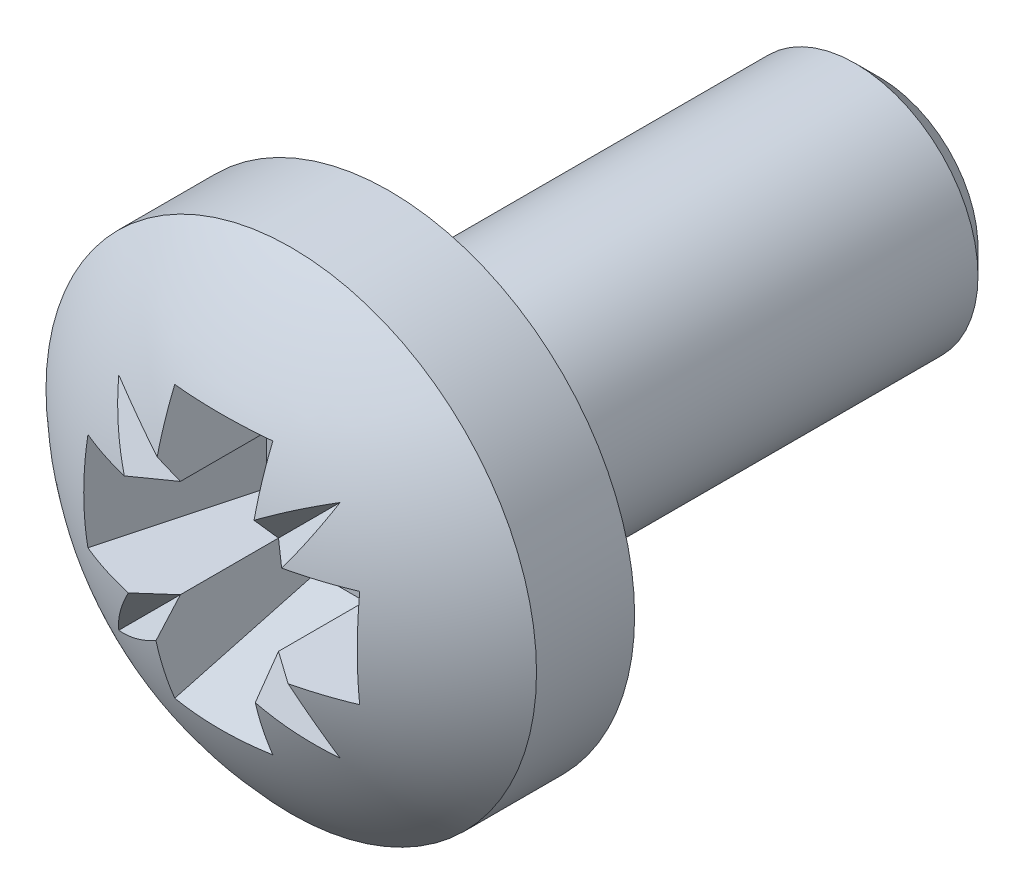
ISO-10303-21;
HEADER;
FILE_DESCRIPTION(('STEP AP214'),'2;1');
FILE_NAME('part.step','',(''),(''),'','','');
FILE_SCHEMA(('AUTOMOTIVE_DESIGN { 1 0 10303 214 1 1 1 1 }'));
ENDSEC;
DATA;
#1=APPLICATION_CONTEXT('core data for automotive mechanical design processes');
#2=APPLICATION_PROTOCOL_DEFINITION('international standard','automotive_design',2000,#1);
#3=PRODUCT_CONTEXT('',#1,'mechanical');
#4=PRODUCT('Part','Part','',(#3));
#5=PRODUCT_RELATED_PRODUCT_CATEGORY('part','',(#4));
#6=PRODUCT_DEFINITION_FORMATION('','',#4);
#7=PRODUCT_DEFINITION_CONTEXT('part definition',#1,'design');
#8=PRODUCT_DEFINITION('design','',#6,#7);
#9=PRODUCT_DEFINITION_SHAPE('','',#8);
#10=(LENGTH_UNIT() NAMED_UNIT(*) SI_UNIT(.MILLI.,.METRE.));
#11=(NAMED_UNIT(*) PLANE_ANGLE_UNIT() SI_UNIT($,.RADIAN.));
#12=(NAMED_UNIT(*) SI_UNIT($,.STERADIAN.) SOLID_ANGLE_UNIT());
#13=UNCERTAINTY_MEASURE_WITH_UNIT(LENGTH_MEASURE(1.E-05),#10,'distance_accuracy_value','');
#14=(GEOMETRIC_REPRESENTATION_CONTEXT(3) GLOBAL_UNCERTAINTY_ASSIGNED_CONTEXT((#13)) GLOBAL_UNIT_ASSIGNED_CONTEXT((#10,
#11,#12)) REPRESENTATION_CONTEXT('',''));
#15=CARTESIAN_POINT('',(0.,0.,0.));
#16=DIRECTION('',(0.,0.,1.));
#17=DIRECTION('',(1.,0.,0.));
#18=AXIS2_PLACEMENT_3D('',#15,#16,#17);
#19=CARTESIAN_POINT('',(0.,0.,1.));
#20=DIRECTION('',(0.,0.,-1.));
#21=DIRECTION('',(-1.,0.,0.));
#22=AXIS2_PLACEMENT_3D('',#19,#20,#21);
#23=CYLINDRICAL_SURFACE('',#22,2.5);
#24=CARTESIAN_POINT('',(0.,0.,1.));
#25=DIRECTION('',(0.,0.,1.));
#26=DIRECTION('',(1.,0.,0.));
#27=AXIS2_PLACEMENT_3D('',#24,#25,#26);
#28=CIRCLE('',#27,2.5);
#29=CARTESIAN_POINT('',(2.5,0.,1.));
#30=VERTEX_POINT('',#29);
#31=EDGE_CURVE('E264',#30,#30,#28,.T.);
#32=ORIENTED_EDGE('',*,*,#31,.F.);
#33=EDGE_LOOP('',(#32));
#34=FACE_BOUND('',#33,.T.);
#35=CARTESIAN_POINT('',(0.,0.,0.));
#36=DIRECTION('',(0.,0.,1.));
#37=DIRECTION('',(1.,0.,0.));
#38=AXIS2_PLACEMENT_3D('',#35,#36,#37);
#39=CIRCLE('',#38,2.5);
#40=CARTESIAN_POINT('',(2.5,0.,0.));
#41=VERTEX_POINT('',#40);
#42=EDGE_CURVE('E248',#41,#41,#39,.T.);
#43=ORIENTED_EDGE('',*,*,#42,.T.);
#44=EDGE_LOOP('',(#43));
#45=FACE_BOUND('',#44,.T.);
#46=ADVANCED_FACE('F33',(#34,#45),#23,.T.);
#47=CARTESIAN_POINT('',(0.,0.,-1.625));
#48=DIRECTION('',(0.,0.,1.));
#49=DIRECTION('',(1.,0.,0.));
#50=AXIS2_PLACEMENT_3D('',#47,#48,#49);
#51=SPHERICAL_SURFACE('',#50,3.625);
#52=CARTESIAN_POINT('',(-1.15094556789194,-1.15094556789194,0.00268283166649885));
#53=DIRECTION('',(0.499999999999922,0.499999999999921,-0.707106781186659));
#54=DIRECTION('',(-0.816496580927812,0.,-0.577350269189505));
#55=AXIS2_PLACEMENT_3D('',#52,#53,#54);
#56=CIRCLE('',#55,2.80034322878427);
#57=CARTESIAN_POINT('',(1.12765672923971,-1.12765672923971,1.63036566333197));
#58=VERTEX_POINT('',#57);
#59=CARTESIAN_POINT('',(0.834639062342882,-0.5,1.86699121356446));
#60=VERTEX_POINT('',#59);
#61=EDGE_CURVE('E48',#58,#60,#56,.F.);
#62=ORIENTED_EDGE('',*,*,#61,.F.);
#63=CARTESIAN_POINT('',(1.15094556789194,1.15094556789194,0.00268283166647955));
#64=DIRECTION('',(-0.499999999999924,-0.499999999999924,-0.707106781186655));
#65=DIRECTION('',(-0.816496580927809,0.,0.577350269189509));
#66=AXIS2_PLACEMENT_3D('',#63,#64,#65);
#67=CIRCLE('',#66,2.80034322878428);
#68=CARTESIAN_POINT('',(0.5,-0.834639062342882,1.86699121356446));
#69=VERTEX_POINT('',#68);
#70=EDGE_CURVE('E167',#69,#58,#67,.F.);
#71=ORIENTED_EDGE('',*,*,#70,.F.);
#72=CARTESIAN_POINT('',(0.5,0.,-1.625));
#73=DIRECTION('',(1.,0.,0.));
#74=DIRECTION('',(0.,1.,0.));
#75=AXIS2_PLACEMENT_3D('',#72,#73,#74);
#76=CIRCLE('',#75,3.59035165408627);
#77=CARTESIAN_POINT('',(0.5,-1.38514981453768,1.68739867638034));
#78=VERTEX_POINT('',#77);
#79=EDGE_CURVE('E278',#78,#69,#76,.F.);
#80=ORIENTED_EDGE('',*,*,#79,.F.);
#81=CARTESIAN_POINT('',(0.,-0.464262701892218,-1.74939881604791));
#82=DIRECTION('',(0.,0.965925826289068,0.258819045102521));
#83=DIRECTION('',(0.,-0.258819045102521,0.965925826289068));
#84=AXIS2_PLACEMENT_3D('',#81,#82,#83);
#85=CIRCLE('',#84,3.59299458365826);
#86=CARTESIAN_POINT('',(-0.5,-1.38514981453768,1.68739867638034));
#87=VERTEX_POINT('',#86);
#88=EDGE_CURVE('E295',#87,#78,#85,.T.);
#89=ORIENTED_EDGE('',*,*,#88,.F.);
#90=CARTESIAN_POINT('',(-0.5,0.,-1.625));
#91=DIRECTION('',(-1.,0.,0.));
#92=DIRECTION('',(0.,-1.,0.));
#93=AXIS2_PLACEMENT_3D('',#90,#91,#92);
#94=CIRCLE('',#93,3.59035165408627);
#95=CARTESIAN_POINT('',(-0.5,-0.781338878854619,1.8793022923815));
#96=VERTEX_POINT('',#95);
#97=EDGE_CURVE('E290',#96,#87,#94,.F.);
#98=ORIENTED_EDGE('',*,*,#97,.F.);
#99=CARTESIAN_POINT('',(-1.12260978110972,1.12260978110972,-0.356268361692934));
#100=DIRECTION('',(0.552387761143332,-0.552387761143333,-0.624288012601646));
#101=DIRECTION('',(0.,0.748917388741033,-0.662663372189313));
#102=AXIS2_PLACEMENT_3D('',#99,#100,#101);
#103=CIRCLE('',#102,3.00173942717756);
#104=CARTESIAN_POINT('',(-1.12765672923971,-1.12765672923971,1.63036566333197));
#105=VERTEX_POINT('',#104);
#106=EDGE_CURVE('E206',#105,#96,#103,.F.);
#107=ORIENTED_EDGE('',*,*,#106,.F.);
#108=CARTESIAN_POINT('',(1.12260978110972,-1.12260978110972,-0.356268361692928));
#109=DIRECTION('',(-0.552387761143332,0.552387761143332,-0.624288012601647));
#110=DIRECTION('',(0.,0.748917388741035,0.662663372189311));
#111=AXIS2_PLACEMENT_3D('',#108,#109,#110);
#112=CIRCLE('',#111,3.00173942717756);
#113=CARTESIAN_POINT('',(-0.781338878854624,-0.500000000000001,1.8793022923815));
#114=VERTEX_POINT('',#113);
#115=EDGE_CURVE('E200',#114,#105,#112,.F.);
#116=ORIENTED_EDGE('',*,*,#115,.F.);
#117=CARTESIAN_POINT('',(0.,-0.500000000000001,-1.625));
#118=DIRECTION('',(0.,-1.,0.));
#119=DIRECTION('',(1.,0.,0.));
#120=AXIS2_PLACEMENT_3D('',#117,#118,#119);
#121=CIRCLE('',#120,3.59035165408627);
#122=CARTESIAN_POINT('',(-1.38514981453768,-0.500000000000001,1.68739867638034));
#123=VERTEX_POINT('',#122);
#124=EDGE_CURVE('E286',#123,#114,#121,.F.);
#125=ORIENTED_EDGE('',*,*,#124,.F.);
#126=CARTESIAN_POINT('',(-0.464262701892218,0.,-1.74939881604791));
#127=DIRECTION('',(0.965925826289068,0.,0.258819045102521));
#128=DIRECTION('',(0.258819045102521,0.,-0.965925826289068));
#129=AXIS2_PLACEMENT_3D('',#126,#127,#128);
#130=CIRCLE('',#129,3.59299458365826);
#131=CARTESIAN_POINT('',(-1.38514981453768,0.500000000000001,1.68739867638034));
#132=VERTEX_POINT('',#131);
#133=EDGE_CURVE('E274',#132,#123,#130,.T.);
#134=ORIENTED_EDGE('',*,*,#133,.F.);
#135=CARTESIAN_POINT('',(0.,0.500000000000001,-1.625));
#136=DIRECTION('',(0.,1.,0.));
#137=DIRECTION('',(-1.,0.,0.));
#138=AXIS2_PLACEMENT_3D('',#135,#136,#137);
#139=CIRCLE('',#138,3.59035165408627);
#140=CARTESIAN_POINT('',(-0.834639062342883,0.500000000000001,1.86699121356446));
#141=VERTEX_POINT('',#140);
#142=EDGE_CURVE('E176',#141,#132,#139,.F.);
#143=ORIENTED_EDGE('',*,*,#142,.F.);
#144=CARTESIAN_POINT('',(-1.12765672923971,1.12765672923971,1.63036566333197));
#145=VERTEX_POINT('',#144);
#146=EDGE_CURVE('E56',#145,#141,#67,.F.);
#147=ORIENTED_EDGE('',*,*,#146,.F.);
#148=CARTESIAN_POINT('',(-0.5,0.834639062342884,1.86699121356446));
#149=VERTEX_POINT('',#148);
#150=EDGE_CURVE('E160',#149,#145,#56,.F.);
#151=ORIENTED_EDGE('',*,*,#150,.F.);
#152=CARTESIAN_POINT('',(-0.5,0.,-1.625));
#153=DIRECTION('',(-1.,0.,0.));
#154=DIRECTION('',(0.,-1.,0.));
#155=AXIS2_PLACEMENT_3D('',#152,#153,#154);
#156=CIRCLE('',#155,3.59035165408627);
#157=CARTESIAN_POINT('',(-0.5,1.38514981453768,1.68739867638034));
#158=VERTEX_POINT('',#157);
#159=EDGE_CURVE('E285',#158,#149,#156,.F.);
#160=ORIENTED_EDGE('',*,*,#159,.F.);
#161=CARTESIAN_POINT('',(0.,0.464262701892218,-1.74939881604791));
#162=DIRECTION('',(0.,-0.965925826289068,0.258819045102521));
#163=DIRECTION('',(0.,-0.258819045102521,-0.965925826289068));
#164=AXIS2_PLACEMENT_3D('',#161,#162,#163);
#165=CIRCLE('',#164,3.59299458365826);
#166=CARTESIAN_POINT('',(0.5,1.38514981453768,1.68739867638034));
#167=VERTEX_POINT('',#166);
#168=EDGE_CURVE('E292',#167,#158,#165,.T.);
#169=ORIENTED_EDGE('',*,*,#168,.F.);
#170=CARTESIAN_POINT('',(0.5,0.,-1.625));
#171=DIRECTION('',(1.,0.,0.));
#172=DIRECTION('',(0.,1.,0.));
#173=AXIS2_PLACEMENT_3D('',#170,#171,#172);
#174=CIRCLE('',#173,3.59035165408627);
#175=CARTESIAN_POINT('',(0.5,0.78133887885462,1.8793022923815));
#176=VERTEX_POINT('',#175);
#177=EDGE_CURVE('E283',#176,#167,#174,.F.);
#178=ORIENTED_EDGE('',*,*,#177,.F.);
#179=CARTESIAN_POINT('',(1.12765672923971,1.12765672923971,1.63036566333197));
#180=VERTEX_POINT('',#179);
#181=EDGE_CURVE('E197',#180,#176,#112,.F.);
#182=ORIENTED_EDGE('',*,*,#181,.F.);
#183=CARTESIAN_POINT('',(0.781338878854622,0.5,1.8793022923815));
#184=VERTEX_POINT('',#183);
#185=EDGE_CURVE('E203',#184,#180,#103,.F.);
#186=ORIENTED_EDGE('',*,*,#185,.F.);
#187=CARTESIAN_POINT('',(0.,0.5,-1.625));
#188=DIRECTION('',(0.,1.,0.));
#189=DIRECTION('',(-1.,0.,0.));
#190=AXIS2_PLACEMENT_3D('',#187,#188,#189);
#191=CIRCLE('',#190,3.59035165408627);
#192=CARTESIAN_POINT('',(1.38514981453768,0.499999999999999,1.68739867638034));
#193=VERTEX_POINT('',#192);
#194=EDGE_CURVE('E280',#193,#184,#191,.F.);
#195=ORIENTED_EDGE('',*,*,#194,.F.);
#196=CARTESIAN_POINT('',(0.464262701892218,0.,-1.74939881604791));
#197=DIRECTION('',(-0.965925826289068,0.,0.258819045102521));
#198=DIRECTION('',(0.258819045102521,0.,0.965925826289068));
#199=AXIS2_PLACEMENT_3D('',#196,#197,#198);
#200=CIRCLE('',#199,3.59299458365826);
#201=CARTESIAN_POINT('',(1.38514981453768,-0.499999999999999,1.68739867638034));
#202=VERTEX_POINT('',#201);
#203=EDGE_CURVE('E279',#202,#193,#200,.T.);
#204=ORIENTED_EDGE('',*,*,#203,.F.);
#205=CARTESIAN_POINT('',(0.,-0.5,-1.625));
#206=DIRECTION('',(0.,-1.,0.));
#207=DIRECTION('',(1.,0.,0.));
#208=AXIS2_PLACEMENT_3D('',#205,#206,#207);
#209=CIRCLE('',#208,3.59035165408627);
#210=EDGE_CURVE('E190',#60,#202,#209,.F.);
#211=ORIENTED_EDGE('',*,*,#210,.F.);
#212=EDGE_LOOP('',(#62,#71,#80,#89,#98,#107,#116,#125,#134,#143,#147,#151,#160,#169,#178,#182,
#186,#195,#204,#211));
#213=FACE_BOUND('',#212,.T.);
#214=ORIENTED_EDGE('',*,*,#31,.T.);
#215=EDGE_LOOP('',(#214));
#216=FACE_BOUND('',#215,.T.);
#217=ADVANCED_FACE('F173',(#213,#216),#51,.T.);
#218=CARTESIAN_POINT('',(0.,0.,0.));
#219=DIRECTION('',(0.,0.,1.));
#220=DIRECTION('',(1.,0.,0.));
#221=AXIS2_PLACEMENT_3D('',#218,#219,#220);
#222=PLANE('',#221);
#223=CARTESIAN_POINT('',(0.,0.,0.));
#224=DIRECTION('',(0.,0.,1.));
#225=DIRECTION('',(1.,0.,0.));
#226=AXIS2_PLACEMENT_3D('',#223,#224,#225);
#227=CIRCLE('',#226,1.25);
#228=CARTESIAN_POINT('',(1.25,0.,0.));
#229=VERTEX_POINT('',#228);
#230=EDGE_CURVE('E265',#229,#229,#227,.F.);
#231=ORIENTED_EDGE('',*,*,#230,.F.);
#232=EDGE_LOOP('',(#231));
#233=FACE_BOUND('',#232,.T.);
#234=ORIENTED_EDGE('',*,*,#42,.F.);
#235=EDGE_LOOP('',(#234));
#236=FACE_BOUND('',#235,.T.);
#237=ADVANCED_FACE('F396',(#233,#236),#222,.F.);
#238=CARTESIAN_POINT('',(0.,0.,-5.));
#239=DIRECTION('',(0.,0.,1.));
#240=DIRECTION('',(1.,0.,0.));
#241=AXIS2_PLACEMENT_3D('',#238,#239,#240);
#242=CYLINDRICAL_SURFACE('',#241,1.25);
#243=CARTESIAN_POINT('',(0.,0.,-4.75));
#244=DIRECTION('',(0.,0.,-1.));
#245=DIRECTION('',(-1.,0.,0.));
#246=AXIS2_PLACEMENT_3D('',#243,#244,#245);
#247=CIRCLE('',#246,1.25);
#248=CARTESIAN_POINT('',(-1.25,0.,-4.75));
#249=VERTEX_POINT('',#248);
#250=EDGE_CURVE('E271',#249,#249,#247,.F.);
#251=ORIENTED_EDGE('',*,*,#250,.T.);
#252=EDGE_LOOP('',(#251));
#253=FACE_BOUND('',#252,.T.);
#254=ORIENTED_EDGE('',*,*,#230,.T.);
#255=EDGE_LOOP('',(#254));
#256=FACE_BOUND('',#255,.T.);
#257=ADVANCED_FACE('F427',(#253,#256),#242,.T.);
#258=CARTESIAN_POINT('',(0.,0.,-5.));
#259=DIRECTION('',(0.,0.,-1.));
#260=DIRECTION('',(-1.,0.,0.));
#261=AXIS2_PLACEMENT_3D('',#258,#259,#260);
#262=PLANE('',#261);
#263=CARTESIAN_POINT('',(0.,0.,-5.));
#264=DIRECTION('',(0.,0.,-1.));
#265=DIRECTION('',(-1.,0.,0.));
#266=AXIS2_PLACEMENT_3D('',#263,#264,#265);
#267=CIRCLE('',#266,0.999999999999999);
#268=CARTESIAN_POINT('',(-0.999999999999999,0.,-5.));
#269=VERTEX_POINT('',#268);
#270=EDGE_CURVE('E268',#269,#269,#267,.T.);
#271=ORIENTED_EDGE('',*,*,#270,.T.);
#272=EDGE_LOOP('',(#271));
#273=FACE_BOUND('',#272,.T.);
#274=ADVANCED_FACE('F405',(#273),#262,.T.);
#275=CARTESIAN_POINT('',(0.,0.,-5.));
#276=DIRECTION('',(0.,0.,1.));
#277=DIRECTION('',(1.,0.,0.));
#278=AXIS2_PLACEMENT_3D('',#275,#276,#277);
#279=CONICAL_SURFACE('',#278,0.999999999999999,0.785398163397447);
#280=ORIENTED_EDGE('',*,*,#250,.F.);
#281=EDGE_LOOP('',(#280));
#282=FACE_BOUND('',#281,.T.);
#283=ORIENTED_EDGE('',*,*,#270,.F.);
#284=EDGE_LOOP('',(#283));
#285=FACE_BOUND('',#284,.T.);
#286=ADVANCED_FACE('F403',(#282,#285),#279,.T.);
#287=CARTESIAN_POINT('',(-0.5,-0.500000000000001,2.));
#288=DIRECTION('',(0.,-1.,0.));
#289=DIRECTION('',(1.,0.,0.));
#290=AXIS2_PLACEMENT_3D('',#287,#288,#289);
#291=PLANE('',#290);
#292=ORIENTED_EDGE('',*,*,#124,.T.);
#293=DIRECTION('',(0.748917388741035,0.,-0.662663372189311));
#294=VECTOR('',#293,1.);
#295=CARTESIAN_POINT('',(-0.683442173813192,-0.500000000000001,1.79268050783723));
#296=LINE('',#295,#294);
#297=CARTESIAN_POINT('',(-0.5,-0.499999999999999,1.63036566333197));
#298=VERTEX_POINT('',#297);
#299=EDGE_CURVE('E199',#114,#298,#296,.T.);
#300=ORIENTED_EDGE('',*,*,#299,.T.);
#301=DIRECTION('',(0.,0.,-1.));
#302=VECTOR('',#301,1.);
#303=CARTESIAN_POINT('',(-0.5,-0.500000000000001,2.));
#304=LINE('',#303,#302);
#305=CARTESIAN_POINT('',(-0.5,-0.500000000000001,0.25));
#306=VERTEX_POINT('',#305);
#307=EDGE_CURVE('E246',#298,#306,#304,.T.);
#308=ORIENTED_EDGE('',*,*,#307,.T.);
#309=DIRECTION('',(-1.,0.,0.));
#310=VECTOR('',#309,1.);
#311=CARTESIAN_POINT('',(-0.5,-0.500000000000001,0.25));
#312=LINE('',#311,#310);
#313=CARTESIAN_POINT('',(-1.,-0.500000000000001,0.25));
#314=VERTEX_POINT('',#313);
#315=EDGE_CURVE('E209',#306,#314,#312,.T.);
#316=ORIENTED_EDGE('',*,*,#315,.T.);
#317=DIRECTION('',(-0.258819045102521,0.,0.965925826289068));
#318=VECTOR('',#317,1.);
#319=CARTESIAN_POINT('',(-1.40400635094611,-0.500000000000001,1.75777222831138));
#320=LINE('',#319,#318);
#321=EDGE_CURVE('E245',#123,#314,#320,.F.);
#322=ORIENTED_EDGE('',*,*,#321,.F.);
#323=EDGE_LOOP('',(#292,#300,#308,#316,#322));
#324=FACE_BOUND('',#323,.T.);
#325=ADVANCED_FACE('F379',(#324),#291,.F.);
#326=CARTESIAN_POINT('',(-0.5,-1.,2.));
#327=DIRECTION('',(-1.,0.,0.));
#328=DIRECTION('',(0.,-1.,0.));
#329=AXIS2_PLACEMENT_3D('',#326,#327,#328);
#330=PLANE('',#329);
#331=ORIENTED_EDGE('',*,*,#307,.F.);
#332=DIRECTION('',(0.,-0.748917388741033,0.662663372189313));
#333=VECTOR('',#332,1.);
#334=CARTESIAN_POINT('',(-0.5,-0.963880801392535,2.04082056899441));
#335=LINE('',#334,#333);
#336=EDGE_CURVE('E205',#298,#96,#335,.T.);
#337=ORIENTED_EDGE('',*,*,#336,.T.);
#338=ORIENTED_EDGE('',*,*,#97,.T.);
#339=DIRECTION('',(0.,-0.258819045102521,0.965925826289068));
#340=VECTOR('',#339,1.);
#341=CARTESIAN_POINT('',(-0.5,-1.,0.25));
#342=LINE('',#341,#340);
#343=CARTESIAN_POINT('',(-0.5,-1.,0.25));
#344=VERTEX_POINT('',#343);
#345=EDGE_CURVE('E249',#87,#344,#342,.F.);
#346=ORIENTED_EDGE('',*,*,#345,.T.);
#347=DIRECTION('',(0.,1.,0.));
#348=VECTOR('',#347,1.);
#349=CARTESIAN_POINT('',(-0.5,-1.,0.25));
#350=LINE('',#349,#348);
#351=EDGE_CURVE('E242',#344,#306,#350,.T.);
#352=ORIENTED_EDGE('',*,*,#351,.T.);
#353=EDGE_LOOP('',(#331,#337,#338,#346,#352));
#354=FACE_BOUND('',#353,.T.);
#355=ADVANCED_FACE('F370',(#354),#330,.F.);
#356=CARTESIAN_POINT('',(-0.5,-1.,0.25));
#357=DIRECTION('',(0.,0.965925826289068,0.258819045102521));
#358=DIRECTION('',(0.,-0.258819045102521,0.965925826289068));
#359=AXIS2_PLACEMENT_3D('',#356,#357,#358);
#360=PLANE('',#359);
#361=ORIENTED_EDGE('',*,*,#88,.T.);
#362=DIRECTION('',(0.,-0.258819045102521,0.965925826289068));
#363=VECTOR('',#362,1.);
#364=CARTESIAN_POINT('',(0.5,-1.4375,1.88277222831138));
#365=LINE('',#364,#363);
#366=CARTESIAN_POINT('',(0.5,-1.,0.25));
#367=VERTEX_POINT('',#366);
#368=EDGE_CURVE('E252',#78,#367,#365,.F.);
#369=ORIENTED_EDGE('',*,*,#368,.T.);
#370=DIRECTION('',(-1.,0.,0.));
#371=VECTOR('',#370,1.);
#372=CARTESIAN_POINT('',(-0.5,-1.,0.25));
#373=LINE('',#372,#371);
#374=EDGE_CURVE('E239',#367,#344,#373,.T.);
#375=ORIENTED_EDGE('',*,*,#374,.T.);
#376=ORIENTED_EDGE('',*,*,#345,.F.);
#377=EDGE_LOOP('',(#361,#369,#375,#376));
#378=FACE_BOUND('',#377,.T.);
#379=ADVANCED_FACE('F367',(#378),#360,.T.);
#380=CARTESIAN_POINT('',(0.5,-1.,2.));
#381=DIRECTION('',(1.,0.,0.));
#382=DIRECTION('',(0.,1.,0.));
#383=AXIS2_PLACEMENT_3D('',#380,#381,#382);
#384=PLANE('',#383);
#385=ORIENTED_EDGE('',*,*,#79,.T.);
#386=DIRECTION('',(0.,0.816496580927809,-0.577350269189509));
#387=VECTOR('',#386,1.);
#388=CARTESIAN_POINT('',(0.5,-1.00758063067829,1.98927936928342));
#389=LINE('',#388,#387);
#390=CARTESIAN_POINT('',(0.499999999999998,-0.5,1.63036566333197));
#391=VERTEX_POINT('',#390);
#392=EDGE_CURVE('E177',#69,#391,#389,.T.);
#393=ORIENTED_EDGE('',*,*,#392,.T.);
#394=DIRECTION('',(0.,0.,-1.));
#395=VECTOR('',#394,1.);
#396=CARTESIAN_POINT('',(0.5,-0.5,2.));
#397=LINE('',#396,#395);
#398=CARTESIAN_POINT('',(0.5,-0.5,0.25));
#399=VERTEX_POINT('',#398);
#400=EDGE_CURVE('E250',#391,#399,#397,.T.);
#401=ORIENTED_EDGE('',*,*,#400,.T.);
#402=DIRECTION('',(0.,-1.,0.));
#403=VECTOR('',#402,1.);
#404=CARTESIAN_POINT('',(0.5,-1.,0.25));
#405=LINE('',#404,#403);
#406=EDGE_CURVE('E236',#399,#367,#405,.T.);
#407=ORIENTED_EDGE('',*,*,#406,.T.);
#408=ORIENTED_EDGE('',*,*,#368,.F.);
#409=EDGE_LOOP('',(#385,#393,#401,#407,#408));
#410=FACE_BOUND('',#409,.T.);
#411=ADVANCED_FACE('F361',(#410),#384,.F.);
#412=CARTESIAN_POINT('',(0.5,-0.5,2.));
#413=DIRECTION('',(0.,-1.,0.));
#414=DIRECTION('',(1.,0.,0.));
#415=AXIS2_PLACEMENT_3D('',#412,#413,#414);
#416=PLANE('',#415);
#417=ORIENTED_EDGE('',*,*,#400,.F.);
#418=DIRECTION('',(0.816496580927812,0.,0.577350269189505));
#419=VECTOR('',#418,1.);
#420=CARTESIAN_POINT('',(0.674247297344883,-0.5,1.75357710888793));
#421=LINE('',#420,#419);
#422=EDGE_CURVE('E166',#391,#60,#421,.T.);
#423=ORIENTED_EDGE('',*,*,#422,.T.);
#424=ORIENTED_EDGE('',*,*,#210,.T.);
#425=DIRECTION('',(0.258819045102521,0.,0.965925826289068));
#426=VECTOR('',#425,1.);
#427=CARTESIAN_POINT('',(1.,-0.5,0.25));
#428=LINE('',#427,#426);
#429=CARTESIAN_POINT('',(1.,-0.499999999999999,0.25));
#430=VERTEX_POINT('',#429);
#431=EDGE_CURVE('E253',#202,#430,#428,.F.);
#432=ORIENTED_EDGE('',*,*,#431,.T.);
#433=DIRECTION('',(-1.,0.,0.));
#434=VECTOR('',#433,1.);
#435=CARTESIAN_POINT('',(0.5,-0.5,0.25));
#436=LINE('',#435,#434);
#437=EDGE_CURVE('E233',#430,#399,#436,.T.);
#438=ORIENTED_EDGE('',*,*,#437,.T.);
#439=EDGE_LOOP('',(#417,#423,#424,#432,#438));
#440=FACE_BOUND('',#439,.T.);
#441=ADVANCED_FACE('F355',(#440),#416,.F.);
#442=CARTESIAN_POINT('',(1.,0.499999999999999,0.25));
#443=DIRECTION('',(-0.965925826289068,0.,0.258819045102521));
#444=DIRECTION('',(0.258819045102521,0.,0.965925826289068));
#445=AXIS2_PLACEMENT_3D('',#442,#443,#444);
#446=PLANE('',#445);
#447=ORIENTED_EDGE('',*,*,#203,.T.);
#448=DIRECTION('',(0.258819045102521,0.,0.965925826289068));
#449=VECTOR('',#448,1.);
#450=CARTESIAN_POINT('',(1.40400635094611,0.499999999999999,1.75777222831138));
#451=LINE('',#450,#449);
#452=CARTESIAN_POINT('',(1.,0.499999999999999,0.25));
#453=VERTEX_POINT('',#452);
#454=EDGE_CURVE('E256',#193,#453,#451,.F.);
#455=ORIENTED_EDGE('',*,*,#454,.T.);
#456=DIRECTION('',(0.,-1.,0.));
#457=VECTOR('',#456,1.);
#458=CARTESIAN_POINT('',(1.,0.499999999999999,0.25));
#459=LINE('',#458,#457);
#460=EDGE_CURVE('E230',#453,#430,#459,.T.);
#461=ORIENTED_EDGE('',*,*,#460,.T.);
#462=ORIENTED_EDGE('',*,*,#431,.F.);
#463=EDGE_LOOP('',(#447,#455,#461,#462));
#464=FACE_BOUND('',#463,.T.);
#465=ADVANCED_FACE('F350',(#464),#446,.T.);
#466=CARTESIAN_POINT('',(0.5,0.5,2.));
#467=DIRECTION('',(0.,1.,0.));
#468=DIRECTION('',(-1.,0.,0.));
#469=AXIS2_PLACEMENT_3D('',#466,#467,#468);
#470=PLANE('',#469);
#471=ORIENTED_EDGE('',*,*,#194,.T.);
#472=DIRECTION('',(-0.748917388741034,0.,-0.662663372189312));
#473=VECTOR('',#472,1.);
#474=CARTESIAN_POINT('',(0.683442173813191,0.5,1.79268050783723));
#475=LINE('',#474,#473);
#476=CARTESIAN_POINT('',(0.499999999999999,0.499999999999998,1.63036566333197));
#477=VERTEX_POINT('',#476);
#478=EDGE_CURVE('E311',#184,#477,#475,.T.);
#479=ORIENTED_EDGE('',*,*,#478,.T.);
#480=DIRECTION('',(0.,0.,-1.));
#481=VECTOR('',#480,1.);
#482=CARTESIAN_POINT('',(0.5,0.5,2.));
#483=LINE('',#482,#481);
#484=CARTESIAN_POINT('',(0.5,0.5,0.25));
#485=VERTEX_POINT('',#484);
#486=EDGE_CURVE('E254',#477,#485,#483,.T.);
#487=ORIENTED_EDGE('',*,*,#486,.T.);
#488=DIRECTION('',(1.,0.,0.));
#489=VECTOR('',#488,1.);
#490=CARTESIAN_POINT('',(0.5,0.5,0.25));
#491=LINE('',#490,#489);
#492=EDGE_CURVE('E227',#485,#453,#491,.T.);
#493=ORIENTED_EDGE('',*,*,#492,.T.);
#494=ORIENTED_EDGE('',*,*,#454,.F.);
#495=EDGE_LOOP('',(#471,#479,#487,#493,#494));
#496=FACE_BOUND('',#495,.T.);
#497=ADVANCED_FACE('F345',(#496),#470,.F.);
#498=CARTESIAN_POINT('',(0.5,1.,2.));
#499=DIRECTION('',(1.,0.,0.));
#500=DIRECTION('',(0.,1.,0.));
#501=AXIS2_PLACEMENT_3D('',#498,#499,#500);
#502=PLANE('',#501);
#503=ORIENTED_EDGE('',*,*,#486,.F.);
#504=DIRECTION('',(0.,0.748917388741035,0.662663372189311));
#505=VECTOR('',#504,1.);
#506=CARTESIAN_POINT('',(0.5,0.963880801392536,2.04082056899441));
#507=LINE('',#506,#505);
#508=EDGE_CURVE('E289',#477,#176,#507,.T.);
#509=ORIENTED_EDGE('',*,*,#508,.T.);
#510=ORIENTED_EDGE('',*,*,#177,.T.);
#511=DIRECTION('',(0.,0.258819045102521,0.965925826289068));
#512=VECTOR('',#511,1.);
#513=CARTESIAN_POINT('',(0.5,1.,0.25));
#514=LINE('',#513,#512);
#515=CARTESIAN_POINT('',(0.5,1.,0.25));
#516=VERTEX_POINT('',#515);
#517=EDGE_CURVE('E257',#167,#516,#514,.F.);
#518=ORIENTED_EDGE('',*,*,#517,.T.);
#519=DIRECTION('',(0.,-1.,0.));
#520=VECTOR('',#519,1.);
#521=CARTESIAN_POINT('',(0.5,1.,0.25));
#522=LINE('',#521,#520);
#523=EDGE_CURVE('E224',#516,#485,#522,.T.);
#524=ORIENTED_EDGE('',*,*,#523,.T.);
#525=EDGE_LOOP('',(#503,#509,#510,#518,#524));
#526=FACE_BOUND('',#525,.T.);
#527=ADVANCED_FACE('F338',(#526),#502,.F.);
#528=CARTESIAN_POINT('',(-0.5,1.,0.25));
#529=DIRECTION('',(0.,-0.965925826289068,0.258819045102521));
#530=DIRECTION('',(0.,-0.258819045102521,-0.965925826289068));
#531=AXIS2_PLACEMENT_3D('',#528,#529,#530);
#532=PLANE('',#531);
#533=ORIENTED_EDGE('',*,*,#168,.T.);
#534=DIRECTION('',(0.,0.258819045102521,0.965925826289068));
#535=VECTOR('',#534,1.);
#536=CARTESIAN_POINT('',(-0.5,1.4375,1.88277222831138));
#537=LINE('',#536,#535);
#538=CARTESIAN_POINT('',(-0.5,1.,0.25));
#539=VERTEX_POINT('',#538);
#540=EDGE_CURVE('E260',#158,#539,#537,.F.);
#541=ORIENTED_EDGE('',*,*,#540,.T.);
#542=DIRECTION('',(1.,0.,0.));
#543=VECTOR('',#542,1.);
#544=CARTESIAN_POINT('',(-0.5,1.,0.25));
#545=LINE('',#544,#543);
#546=EDGE_CURVE('E221',#539,#516,#545,.T.);
#547=ORIENTED_EDGE('',*,*,#546,.T.);
#548=ORIENTED_EDGE('',*,*,#517,.F.);
#549=EDGE_LOOP('',(#533,#541,#547,#548));
#550=FACE_BOUND('',#549,.T.);
#551=ADVANCED_FACE('F331',(#550),#532,.T.);
#552=CARTESIAN_POINT('',(-0.5,1.,2.));
#553=DIRECTION('',(-1.,0.,0.));
#554=DIRECTION('',(0.,-1.,0.));
#555=AXIS2_PLACEMENT_3D('',#552,#553,#554);
#556=PLANE('',#555);
#557=ORIENTED_EDGE('',*,*,#159,.T.);
#558=DIRECTION('',(0.,-0.816496580927812,-0.577350269189504));
#559=VECTOR('',#558,1.);
#560=CARTESIAN_POINT('',(-0.5,1.00758063067829,1.98927936928342));
#561=LINE('',#560,#559);
#562=CARTESIAN_POINT('',(-0.500000000000001,0.500000000000001,1.63036566333197));
#563=VERTEX_POINT('',#562);
#564=EDGE_CURVE('E11',#149,#563,#561,.T.);
#565=ORIENTED_EDGE('',*,*,#564,.T.);
#566=DIRECTION('',(0.,0.,-1.));
#567=VECTOR('',#566,1.);
#568=CARTESIAN_POINT('',(-0.5,0.500000000000001,2.));
#569=LINE('',#568,#567);
#570=CARTESIAN_POINT('',(-0.5,0.500000000000001,0.25));
#571=VERTEX_POINT('',#570);
#572=EDGE_CURVE('E258',#563,#571,#569,.T.);
#573=ORIENTED_EDGE('',*,*,#572,.T.);
#574=DIRECTION('',(0.,1.,0.));
#575=VECTOR('',#574,1.);
#576=CARTESIAN_POINT('',(-0.5,1.,0.25));
#577=LINE('',#576,#575);
#578=EDGE_CURVE('E218',#571,#539,#577,.T.);
#579=ORIENTED_EDGE('',*,*,#578,.T.);
#580=ORIENTED_EDGE('',*,*,#540,.F.);
#581=EDGE_LOOP('',(#557,#565,#573,#579,#580));
#582=FACE_BOUND('',#581,.T.);
#583=ADVANCED_FACE('F320',(#582),#556,.F.);
#584=CARTESIAN_POINT('',(-0.5,0.500000000000001,2.));
#585=DIRECTION('',(0.,1.,0.));
#586=DIRECTION('',(-1.,0.,0.));
#587=AXIS2_PLACEMENT_3D('',#584,#585,#586);
#588=PLANE('',#587);
#589=ORIENTED_EDGE('',*,*,#572,.F.);
#590=DIRECTION('',(-0.816496580927808,0.,0.577350269189509));
#591=VECTOR('',#590,1.);
#592=CARTESIAN_POINT('',(-0.674247297344885,0.500000000000001,1.75357710888793));
#593=LINE('',#592,#591);
#594=EDGE_CURVE('E41',#563,#141,#593,.T.);
#595=ORIENTED_EDGE('',*,*,#594,.T.);
#596=ORIENTED_EDGE('',*,*,#142,.T.);
#597=DIRECTION('',(-0.258819045102521,0.,0.965925826289068));
#598=VECTOR('',#597,1.);
#599=CARTESIAN_POINT('',(-1.,0.500000000000001,0.25));
#600=LINE('',#599,#598);
#601=CARTESIAN_POINT('',(-1.,0.500000000000001,0.25));
#602=VERTEX_POINT('',#601);
#603=EDGE_CURVE('E261',#132,#602,#600,.F.);
#604=ORIENTED_EDGE('',*,*,#603,.T.);
#605=DIRECTION('',(1.,0.,0.));
#606=VECTOR('',#605,1.);
#607=CARTESIAN_POINT('',(-0.5,0.500000000000001,0.25));
#608=LINE('',#607,#606);
#609=EDGE_CURVE('E215',#602,#571,#608,.T.);
#610=ORIENTED_EDGE('',*,*,#609,.T.);
#611=EDGE_LOOP('',(#589,#595,#596,#604,#610));
#612=FACE_BOUND('',#611,.T.);
#613=ADVANCED_FACE('F315',(#612),#588,.F.);
#614=CARTESIAN_POINT('',(-1.,0.500000000000001,0.25));
#615=DIRECTION('',(0.965925826289068,0.,0.258819045102521));
#616=DIRECTION('',(0.258819045102521,0.,-0.965925826289068));
#617=AXIS2_PLACEMENT_3D('',#614,#615,#616);
#618=PLANE('',#617);
#619=ORIENTED_EDGE('',*,*,#133,.T.);
#620=ORIENTED_EDGE('',*,*,#321,.T.);
#621=DIRECTION('',(0.,1.,0.));
#622=VECTOR('',#621,1.);
#623=CARTESIAN_POINT('',(-1.,0.500000000000001,0.25));
#624=LINE('',#623,#622);
#625=EDGE_CURVE('E212',#314,#602,#624,.T.);
#626=ORIENTED_EDGE('',*,*,#625,.T.);
#627=ORIENTED_EDGE('',*,*,#603,.F.);
#628=EDGE_LOOP('',(#619,#620,#626,#627));
#629=FACE_BOUND('',#628,.T.);
#630=ADVANCED_FACE('F35',(#629),#618,.T.);
#631=CARTESIAN_POINT('',(0.499999999999999,-0.500000000000002,0.25));
#632=DIRECTION('',(0.,0.,1.));
#633=DIRECTION('',(1.,0.,0.));
#634=AXIS2_PLACEMENT_3D('',#631,#632,#633);
#635=PLANE('',#634);
#636=ORIENTED_EDGE('',*,*,#315,.F.);
#637=ORIENTED_EDGE('',*,*,#351,.F.);
#638=ORIENTED_EDGE('',*,*,#374,.F.);
#639=ORIENTED_EDGE('',*,*,#406,.F.);
#640=ORIENTED_EDGE('',*,*,#437,.F.);
#641=ORIENTED_EDGE('',*,*,#460,.F.);
#642=ORIENTED_EDGE('',*,*,#492,.F.);
#643=ORIENTED_EDGE('',*,*,#523,.F.);
#644=ORIENTED_EDGE('',*,*,#546,.F.);
#645=ORIENTED_EDGE('',*,*,#578,.F.);
#646=ORIENTED_EDGE('',*,*,#609,.F.);
#647=ORIENTED_EDGE('',*,*,#625,.F.);
#648=EDGE_LOOP('',(#636,#637,#638,#639,#640,#641,#642,#643,#644,#645,#646,#647));
#649=FACE_BOUND('',#648,.T.);
#650=ADVANCED_FACE('F325',(#649),#635,.T.);
#651=CARTESIAN_POINT('',(-2.64066943942731,-2.35933056057269,1.8793022923815));
#652=DIRECTION('',(-0.552387761143332,0.552387761143332,-0.624288012601647));
#653=DIRECTION('',(0.,0.748917388741035,0.662663372189311));
#654=AXIS2_PLACEMENT_3D('',#651,#652,#653);
#655=PLANE('',#654);
#656=ORIENTED_EDGE('',*,*,#181,.T.);
#657=ORIENTED_EDGE('',*,*,#508,.F.);
#658=DIRECTION('',(0.707106781186548,0.707106781186547,0.));
#659=VECTOR('',#658,1.);
#660=CARTESIAN_POINT('',(-2.5,-2.5,1.63036566333197));
#661=LINE('',#660,#659);
#662=EDGE_CURVE('E191',#477,#180,#661,.T.);
#663=ORIENTED_EDGE('',*,*,#662,.T.);
#664=EDGE_LOOP('',(#656,#657,#663));
#665=FACE_BOUND('',#664,.T.);
#666=ADVANCED_FACE('F341',(#665),#655,.F.);
#667=CARTESIAN_POINT('',(-2.35933056057269,-2.64066943942731,1.8793022923815));
#668=DIRECTION('',(0.552387761143332,-0.552387761143333,-0.624288012601646));
#669=DIRECTION('',(0.,0.748917388741033,-0.662663372189313));
#670=AXIS2_PLACEMENT_3D('',#667,#668,#669);
#671=PLANE('',#670);
#672=ORIENTED_EDGE('',*,*,#185,.T.);
#673=ORIENTED_EDGE('',*,*,#662,.F.);
#674=ORIENTED_EDGE('',*,*,#478,.F.);
#675=EDGE_LOOP('',(#672,#673,#674));
#676=FACE_BOUND('',#675,.T.);
#677=ADVANCED_FACE('F343',(#676),#671,.F.);
#678=ORIENTED_EDGE('',*,*,#106,.T.);
#679=ORIENTED_EDGE('',*,*,#336,.F.);
#680=EDGE_CURVE('E193',#105,#298,#661,.T.);
#681=ORIENTED_EDGE('',*,*,#680,.F.);
#682=EDGE_LOOP('',(#678,#679,#681));
#683=FACE_BOUND('',#682,.T.);
#684=ADVANCED_FACE('F374',(#683),#671,.F.);
#685=ORIENTED_EDGE('',*,*,#115,.T.);
#686=ORIENTED_EDGE('',*,*,#680,.T.);
#687=ORIENTED_EDGE('',*,*,#299,.F.);
#688=EDGE_LOOP('',(#685,#686,#687));
#689=FACE_BOUND('',#688,.T.);
#690=ADVANCED_FACE('F376',(#689),#655,.F.);
#691=CARTESIAN_POINT('',(-2.66731953117144,2.33268046882856,1.86699121356446));
#692=DIRECTION('',(-0.499999999999924,-0.499999999999924,-0.707106781186655));
#693=DIRECTION('',(-0.816496580927809,0.,0.577350269189509));
#694=AXIS2_PLACEMENT_3D('',#691,#692,#693);
#695=PLANE('',#694);
#696=ORIENTED_EDGE('',*,*,#146,.T.);
#697=ORIENTED_EDGE('',*,*,#594,.F.);
#698=DIRECTION('',(0.707106781186547,-0.707106781186548,0.));
#699=VECTOR('',#698,1.);
#700=CARTESIAN_POINT('',(-2.5,2.5,1.63036566333197));
#701=LINE('',#700,#699);
#702=EDGE_CURVE('E162',#145,#563,#701,.T.);
#703=ORIENTED_EDGE('',*,*,#702,.F.);
#704=EDGE_LOOP('',(#696,#697,#703));
#705=FACE_BOUND('',#704,.T.);
#706=ADVANCED_FACE('F169',(#705),#695,.F.);
#707=CARTESIAN_POINT('',(-2.33268046882856,2.66731953117144,1.86699121356446));
#708=DIRECTION('',(0.499999999999922,0.499999999999921,-0.707106781186659));
#709=DIRECTION('',(-0.816496580927812,0.,-0.577350269189505));
#710=AXIS2_PLACEMENT_3D('',#707,#708,#709);
#711=PLANE('',#710);
#712=ORIENTED_EDGE('',*,*,#150,.T.);
#713=ORIENTED_EDGE('',*,*,#702,.T.);
#714=ORIENTED_EDGE('',*,*,#564,.F.);
#715=EDGE_LOOP('',(#712,#713,#714));
#716=FACE_BOUND('',#715,.T.);
#717=ADVANCED_FACE('F161',(#716),#711,.F.);
#718=ORIENTED_EDGE('',*,*,#61,.T.);
#719=ORIENTED_EDGE('',*,*,#422,.F.);
#720=EDGE_CURVE('E170',#391,#58,#701,.T.);
#721=ORIENTED_EDGE('',*,*,#720,.T.);
#722=EDGE_LOOP('',(#718,#719,#721));
#723=FACE_BOUND('',#722,.T.);
#724=ADVANCED_FACE('F187',(#723),#711,.F.);
#725=ORIENTED_EDGE('',*,*,#70,.T.);
#726=ORIENTED_EDGE('',*,*,#720,.F.);
#727=ORIENTED_EDGE('',*,*,#392,.F.);
#728=EDGE_LOOP('',(#725,#726,#727));
#729=FACE_BOUND('',#728,.T.);
#730=ADVANCED_FACE('F184',(#729),#695,.F.);
#731=CLOSED_SHELL('',(#46,#217,#237,#257,#274,#286,#325,#355,#379,#411,#441,#465,#497,#527,#551,
#583,#613,#630,#650,#666,#677,#684,#690,#706,#717,#724,#730));
#732=MANIFOLD_SOLID_BREP('B2',#731);
#733=ADVANCED_BREP_SHAPE_REPRESENTATION('',(#18,#732),#14);
#734=SHAPE_DEFINITION_REPRESENTATION(#9,#733);
ENDSEC;
END-ISO-10303-21;
